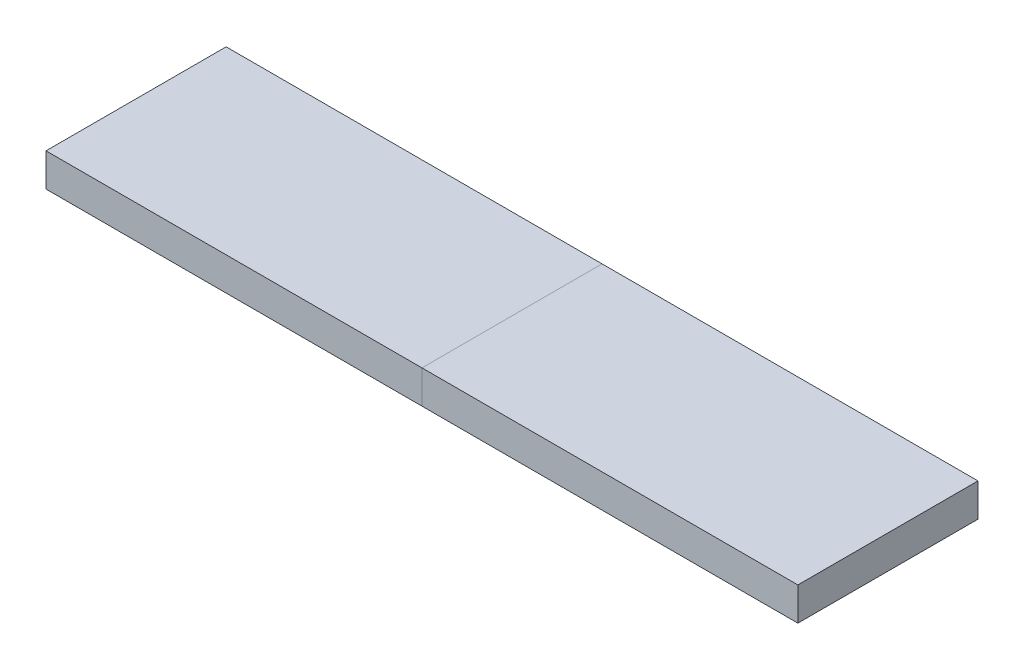
ISO-10303-21;
HEADER;
FILE_DESCRIPTION(('STEP AP214'),'2;1');
FILE_NAME('part.step','',(''),(''),'','','');
FILE_SCHEMA(('AUTOMOTIVE_DESIGN { 1 0 10303 214 1 1 1 1 }'));
ENDSEC;
DATA;
#1=APPLICATION_CONTEXT('core data for automotive mechanical design processes');
#2=APPLICATION_PROTOCOL_DEFINITION('international standard','automotive_design',2000,#1);
#3=PRODUCT_CONTEXT('',#1,'mechanical');
#4=PRODUCT('Part','Part','',(#3));
#5=PRODUCT_RELATED_PRODUCT_CATEGORY('part','',(#4));
#6=PRODUCT_DEFINITION_FORMATION('','',#4);
#7=PRODUCT_DEFINITION_CONTEXT('part definition',#1,'design');
#8=PRODUCT_DEFINITION('design','',#6,#7);
#9=PRODUCT_DEFINITION_SHAPE('','',#8);
#10=(LENGTH_UNIT() NAMED_UNIT(*) SI_UNIT(.MILLI.,.METRE.));
#11=(NAMED_UNIT(*) PLANE_ANGLE_UNIT() SI_UNIT($,.RADIAN.));
#12=(NAMED_UNIT(*) SI_UNIT($,.STERADIAN.) SOLID_ANGLE_UNIT());
#13=UNCERTAINTY_MEASURE_WITH_UNIT(LENGTH_MEASURE(1.E-05),#10,'distance_accuracy_value','');
#14=(GEOMETRIC_REPRESENTATION_CONTEXT(3) GLOBAL_UNCERTAINTY_ASSIGNED_CONTEXT((#13)) GLOBAL_UNIT_ASSIGNED_CONTEXT((#10,
#11,#12)) REPRESENTATION_CONTEXT('',''));
#15=CARTESIAN_POINT('',(0.,0.,0.));
#16=DIRECTION('',(0.,0.,1.));
#17=DIRECTION('',(1.,0.,0.));
#18=AXIS2_PLACEMENT_3D('',#15,#16,#17);
#19=CARTESIAN_POINT('',(0.,-6.36,34.5));
#20=DIRECTION('',(1.,0.,0.));
#21=DIRECTION('',(0.,0.,-1.));
#22=AXIS2_PLACEMENT_3D('',#19,#20,#21);
#23=PLANE('',#22);
#24=DIRECTION('',(0.,-1.,0.));
#25=VECTOR('',#24,1.);
#26=CARTESIAN_POINT('',(0.,6.35,34.5));
#27=LINE('',#26,#25);
#28=CARTESIAN_POINT('',(0.,6.35,34.5));
#29=VERTEX_POINT('',#28);
#30=CARTESIAN_POINT('',(0.,-6.35,34.5));
#31=VERTEX_POINT('',#30);
#32=EDGE_CURVE('E176',#29,#31,#27,.T.);
#33=ORIENTED_EDGE('',*,*,#32,.T.);
#34=DIRECTION('',(0.,0.,-1.));
#35=VECTOR('',#34,1.);
#36=CARTESIAN_POINT('',(0.,-6.35,0.));
#37=LINE('',#36,#35);
#38=CARTESIAN_POINT('',(0.,-6.35,30.95625));
#39=VERTEX_POINT('',#38);
#40=EDGE_CURVE('E179',#31,#39,#37,.T.);
#41=ORIENTED_EDGE('',*,*,#40,.T.);
#42=DIRECTION('',(0.,1.,0.));
#43=VECTOR('',#42,1.);
#44=CARTESIAN_POINT('',(0.,0.,30.95625));
#45=LINE('',#44,#43);
#46=CARTESIAN_POINT('',(0.,0.,30.95625));
#47=VERTEX_POINT('',#46);
#48=EDGE_CURVE('E186',#39,#47,#45,.T.);
#49=ORIENTED_EDGE('',*,*,#48,.T.);
#50=DIRECTION('',(0.,0.,-1.));
#51=VECTOR('',#50,1.);
#52=CARTESIAN_POINT('',(0.,0.,0.));
#53=LINE('',#52,#51);
#54=CARTESIAN_POINT('',(0.,0.,27.5));
#55=VERTEX_POINT('',#54);
#56=EDGE_CURVE('E170',#47,#55,#53,.T.);
#57=ORIENTED_EDGE('',*,*,#56,.T.);
#58=DIRECTION('',(0.,1.,0.));
#59=VECTOR('',#58,1.);
#60=CARTESIAN_POINT('',(0.,4.,27.5));
#61=LINE('',#60,#59);
#62=CARTESIAN_POINT('',(0.,4.,27.5));
#63=VERTEX_POINT('',#62);
#64=EDGE_CURVE('E192',#55,#63,#61,.T.);
#65=ORIENTED_EDGE('',*,*,#64,.T.);
#66=DIRECTION('',(0.,0.,1.));
#67=VECTOR('',#66,1.);
#68=CARTESIAN_POINT('',(0.,4.,0.));
#69=LINE('',#68,#67);
#70=CARTESIAN_POINT('',(0.,4.,-27.5));
#71=VERTEX_POINT('',#70);
#72=EDGE_CURVE('E136',#71,#63,#69,.T.);
#73=ORIENTED_EDGE('',*,*,#72,.F.);
#74=DIRECTION('',(0.,-1.,0.));
#75=VECTOR('',#74,1.);
#76=CARTESIAN_POINT('',(0.,4.,-27.5));
#77=LINE('',#76,#75);
#78=CARTESIAN_POINT('',(0.,0.,-27.5));
#79=VERTEX_POINT('',#78);
#80=EDGE_CURVE('E189',#71,#79,#77,.T.);
#81=ORIENTED_EDGE('',*,*,#80,.T.);
#82=CARTESIAN_POINT('',(0.,0.,-30.95625));
#83=VERTEX_POINT('',#82);
#84=EDGE_CURVE('E171',#79,#83,#53,.T.);
#85=ORIENTED_EDGE('',*,*,#84,.T.);
#86=DIRECTION('',(0.,-1.,0.));
#87=VECTOR('',#86,1.);
#88=CARTESIAN_POINT('',(0.,0.,-30.95625));
#89=LINE('',#88,#87);
#90=CARTESIAN_POINT('',(0.,-6.35,-30.95625));
#91=VERTEX_POINT('',#90);
#92=EDGE_CURVE('E183',#83,#91,#89,.T.);
#93=ORIENTED_EDGE('',*,*,#92,.T.);
#94=CARTESIAN_POINT('',(0.,-6.35,-34.5));
#95=VERTEX_POINT('',#94);
#96=EDGE_CURVE('E180',#91,#95,#37,.T.);
#97=ORIENTED_EDGE('',*,*,#96,.T.);
#98=DIRECTION('',(0.,1.,0.));
#99=VECTOR('',#98,1.);
#100=CARTESIAN_POINT('',(0.,6.35,-34.5));
#101=LINE('',#100,#99);
#102=CARTESIAN_POINT('',(0.,6.35,-34.5));
#103=VERTEX_POINT('',#102);
#104=EDGE_CURVE('E174',#95,#103,#101,.T.);
#105=ORIENTED_EDGE('',*,*,#104,.T.);
#106=DIRECTION('',(0.,0.,-1.));
#107=VECTOR('',#106,1.);
#108=CARTESIAN_POINT('',(0.,6.35,0.));
#109=LINE('',#108,#107);
#110=EDGE_CURVE('E127',#29,#103,#109,.T.);
#111=ORIENTED_EDGE('',*,*,#110,.F.);
#112=EDGE_LOOP('',(#33,#41,#49,#57,#65,#73,#81,#85,#93,#97,#105,#111));
#113=FACE_BOUND('',#112,.T.);
#114=ADVANCED_FACE('F48',(#113),#23,.T.);
#115=CARTESIAN_POINT('',(-144.,6.35,-34.5));
#116=DIRECTION('',(0.,0.,1.));
#117=DIRECTION('',(1.,0.,0.));
#118=AXIS2_PLACEMENT_3D('',#115,#116,#117);
#119=PLANE('',#118);
#120=ORIENTED_EDGE('',*,*,#104,.F.);
#121=DIRECTION('',(-1.,0.,0.));
#122=VECTOR('',#121,1.);
#123=CARTESIAN_POINT('',(-144.,-6.35,-34.5));
#124=LINE('',#123,#122);
#125=CARTESIAN_POINT('',(-144.,-6.35,-34.5));
#126=VERTEX_POINT('',#125);
#127=EDGE_CURVE('E105',#95,#126,#124,.T.);
#128=ORIENTED_EDGE('',*,*,#127,.T.);
#129=DIRECTION('',(0.,-1.,0.));
#130=VECTOR('',#129,1.);
#131=CARTESIAN_POINT('',(-144.,6.35,-34.5));
#132=LINE('',#131,#130);
#133=CARTESIAN_POINT('',(-144.,6.35,-34.5));
#134=VERTEX_POINT('',#133);
#135=EDGE_CURVE('E131',#134,#126,#132,.T.);
#136=ORIENTED_EDGE('',*,*,#135,.F.);
#137=DIRECTION('',(-1.,0.,0.));
#138=VECTOR('',#137,1.);
#139=CARTESIAN_POINT('',(-144.,6.35,-34.5));
#140=LINE('',#139,#138);
#141=EDGE_CURVE('E119',#103,#134,#140,.T.);
#142=ORIENTED_EDGE('',*,*,#141,.F.);
#143=EDGE_LOOP('',(#120,#128,#136,#142));
#144=FACE_BOUND('',#143,.T.);
#145=ADVANCED_FACE('F132',(#144),#119,.F.);
#146=CARTESIAN_POINT('',(-144.,6.35,-34.5));
#147=DIRECTION('',(1.,0.,0.));
#148=DIRECTION('',(0.,0.,-1.));
#149=AXIS2_PLACEMENT_3D('',#146,#147,#148);
#150=PLANE('',#149);
#151=DIRECTION('',(0.,0.,1.));
#152=VECTOR('',#151,1.);
#153=CARTESIAN_POINT('',(-144.,-6.35,-34.5));
#154=LINE('',#153,#152);
#155=CARTESIAN_POINT('',(-144.,-6.35,34.5));
#156=VERTEX_POINT('',#155);
#157=EDGE_CURVE('E146',#126,#156,#154,.T.);
#158=ORIENTED_EDGE('',*,*,#157,.T.);
#159=DIRECTION('',(0.,-1.,0.));
#160=VECTOR('',#159,1.);
#161=CARTESIAN_POINT('',(-144.,6.35,34.5));
#162=LINE('',#161,#160);
#163=CARTESIAN_POINT('',(-144.,6.35,34.5));
#164=VERTEX_POINT('',#163);
#165=EDGE_CURVE('E135',#164,#156,#162,.T.);
#166=ORIENTED_EDGE('',*,*,#165,.F.);
#167=DIRECTION('',(0.,0.,1.));
#168=VECTOR('',#167,1.);
#169=CARTESIAN_POINT('',(-144.,6.35,-34.5));
#170=LINE('',#169,#168);
#171=EDGE_CURVE('E123',#134,#164,#170,.T.);
#172=ORIENTED_EDGE('',*,*,#171,.F.);
#173=ORIENTED_EDGE('',*,*,#135,.T.);
#174=EDGE_LOOP('',(#158,#166,#172,#173));
#175=FACE_BOUND('',#174,.T.);
#176=ADVANCED_FACE('F138',(#175),#150,.F.);
#177=CARTESIAN_POINT('',(-144.,6.35,34.5));
#178=DIRECTION('',(0.,0.,-1.));
#179=DIRECTION('',(-1.,0.,0.));
#180=AXIS2_PLACEMENT_3D('',#177,#178,#179);
#181=PLANE('',#180);
#182=ORIENTED_EDGE('',*,*,#32,.F.);
#183=DIRECTION('',(1.,0.,0.));
#184=VECTOR('',#183,1.);
#185=CARTESIAN_POINT('',(-144.,6.35,34.5));
#186=LINE('',#185,#184);
#187=EDGE_CURVE('E141',#164,#29,#186,.T.);
#188=ORIENTED_EDGE('',*,*,#187,.F.);
#189=ORIENTED_EDGE('',*,*,#165,.T.);
#190=DIRECTION('',(1.,0.,0.));
#191=VECTOR('',#190,1.);
#192=CARTESIAN_POINT('',(-144.,-6.35,34.5));
#193=LINE('',#192,#191);
#194=EDGE_CURVE('E129',#156,#31,#193,.T.);
#195=ORIENTED_EDGE('',*,*,#194,.T.);
#196=EDGE_LOOP('',(#182,#188,#189,#195));
#197=FACE_BOUND('',#196,.T.);
#198=ADVANCED_FACE('F257',(#197),#181,.F.);
#199=CARTESIAN_POINT('',(0.,0.,0.));
#200=DIRECTION('',(0.,1.,0.));
#201=DIRECTION('',(0.,0.,1.));
#202=AXIS2_PLACEMENT_3D('',#199,#200,#201);
#203=PLANE('',#202);
#204=ORIENTED_EDGE('',*,*,#56,.F.);
#205=DIRECTION('',(-1.,0.,0.));
#206=VECTOR('',#205,1.);
#207=CARTESIAN_POINT('',(-140.096875,0.,30.95625));
#208=LINE('',#207,#206);
#209=CARTESIAN_POINT('',(-140.096875,0.,30.95625));
#210=VERTEX_POINT('',#209);
#211=EDGE_CURVE('E157',#47,#210,#208,.T.);
#212=ORIENTED_EDGE('',*,*,#211,.T.);
#213=DIRECTION('',(0.,0.,-1.));
#214=VECTOR('',#213,1.);
#215=CARTESIAN_POINT('',(-140.096875,0.,-30.95625));
#216=LINE('',#215,#214);
#217=CARTESIAN_POINT('',(-140.096875,0.,-30.95625));
#218=VERTEX_POINT('',#217);
#219=EDGE_CURVE('E155',#210,#218,#216,.T.);
#220=ORIENTED_EDGE('',*,*,#219,.T.);
#221=DIRECTION('',(1.,0.,0.));
#222=VECTOR('',#221,1.);
#223=CARTESIAN_POINT('',(-140.096875,0.,-30.95625));
#224=LINE('',#223,#222);
#225=EDGE_CURVE('E150',#218,#83,#224,.T.);
#226=ORIENTED_EDGE('',*,*,#225,.T.);
#227=ORIENTED_EDGE('',*,*,#84,.F.);
#228=DIRECTION('',(1.,0.,0.));
#229=VECTOR('',#228,1.);
#230=CARTESIAN_POINT('',(-135.675,0.,-27.5));
#231=LINE('',#230,#229);
#232=CARTESIAN_POINT('',(-135.675,0.,-27.5));
#233=VERTEX_POINT('',#232);
#234=EDGE_CURVE('E163',#233,#79,#231,.T.);
#235=ORIENTED_EDGE('',*,*,#234,.F.);
#236=DIRECTION('',(0.,0.,-1.));
#237=VECTOR('',#236,1.);
#238=CARTESIAN_POINT('',(-135.675,0.,27.5));
#239=LINE('',#238,#237);
#240=CARTESIAN_POINT('',(-135.675,0.,27.5));
#241=VERTEX_POINT('',#240);
#242=EDGE_CURVE('E57',#241,#233,#239,.T.);
#243=ORIENTED_EDGE('',*,*,#242,.F.);
#244=DIRECTION('',(-1.,0.,0.));
#245=VECTOR('',#244,1.);
#246=CARTESIAN_POINT('',(-135.675,0.,27.5));
#247=LINE('',#246,#245);
#248=EDGE_CURVE('E12',#55,#241,#247,.T.);
#249=ORIENTED_EDGE('',*,*,#248,.F.);
#250=EDGE_LOOP('',(#204,#212,#220,#226,#227,#235,#243,#249));
#251=FACE_BOUND('',#250,.T.);
#252=ADVANCED_FACE('F221',(#251),#203,.F.);
#253=CARTESIAN_POINT('',(-135.675,4.,27.5));
#254=DIRECTION('',(-1.,0.,0.));
#255=DIRECTION('',(0.,0.,1.));
#256=AXIS2_PLACEMENT_3D('',#253,#254,#255);
#257=PLANE('',#256);
#258=ORIENTED_EDGE('',*,*,#242,.T.);
#259=DIRECTION('',(0.,-1.,0.));
#260=VECTOR('',#259,1.);
#261=CARTESIAN_POINT('',(-135.675,4.,-27.5));
#262=LINE('',#261,#260);
#263=CARTESIAN_POINT('',(-135.675,4.,-27.5));
#264=VERTEX_POINT('',#263);
#265=EDGE_CURVE('E75',#264,#233,#262,.T.);
#266=ORIENTED_EDGE('',*,*,#265,.F.);
#267=DIRECTION('',(0.,0.,-1.));
#268=VECTOR('',#267,1.);
#269=CARTESIAN_POINT('',(-135.675,4.,27.5));
#270=LINE('',#269,#268);
#271=CARTESIAN_POINT('',(-135.675,4.,27.5));
#272=VERTEX_POINT('',#271);
#273=EDGE_CURVE('E164',#272,#264,#270,.T.);
#274=ORIENTED_EDGE('',*,*,#273,.F.);
#275=DIRECTION('',(0.,-1.,0.));
#276=VECTOR('',#275,1.);
#277=CARTESIAN_POINT('',(-135.675,4.,27.5));
#278=LINE('',#277,#276);
#279=EDGE_CURVE('E158',#272,#241,#278,.T.);
#280=ORIENTED_EDGE('',*,*,#279,.T.);
#281=EDGE_LOOP('',(#258,#266,#274,#280));
#282=FACE_BOUND('',#281,.T.);
#283=ADVANCED_FACE('F250',(#282),#257,.F.);
#284=CARTESIAN_POINT('',(-135.675,4.,27.5));
#285=DIRECTION('',(0.,0.,1.));
#286=DIRECTION('',(1.,0.,0.));
#287=AXIS2_PLACEMENT_3D('',#284,#285,#286);
#288=PLANE('',#287);
#289=ORIENTED_EDGE('',*,*,#64,.F.);
#290=ORIENTED_EDGE('',*,*,#248,.T.);
#291=ORIENTED_EDGE('',*,*,#279,.F.);
#292=DIRECTION('',(-1.,0.,0.));
#293=VECTOR('',#292,1.);
#294=CARTESIAN_POINT('',(-135.675,4.,27.5));
#295=LINE('',#294,#293);
#296=EDGE_CURVE('E166',#63,#272,#295,.T.);
#297=ORIENTED_EDGE('',*,*,#296,.F.);
#298=EDGE_LOOP('',(#289,#290,#291,#297));
#299=FACE_BOUND('',#298,.T.);
#300=ADVANCED_FACE('F249',(#299),#288,.F.);
#301=CARTESIAN_POINT('',(-135.675,4.,-27.5));
#302=DIRECTION('',(0.,0.,-1.));
#303=DIRECTION('',(-1.,0.,0.));
#304=AXIS2_PLACEMENT_3D('',#301,#302,#303);
#305=PLANE('',#304);
#306=ORIENTED_EDGE('',*,*,#80,.F.);
#307=DIRECTION('',(1.,0.,0.));
#308=VECTOR('',#307,1.);
#309=CARTESIAN_POINT('',(-135.675,4.,-27.5));
#310=LINE('',#309,#308);
#311=EDGE_CURVE('E160',#264,#71,#310,.T.);
#312=ORIENTED_EDGE('',*,*,#311,.F.);
#313=ORIENTED_EDGE('',*,*,#265,.T.);
#314=ORIENTED_EDGE('',*,*,#234,.T.);
#315=EDGE_LOOP('',(#306,#312,#313,#314));
#316=FACE_BOUND('',#315,.T.);
#317=ADVANCED_FACE('F212',(#316),#305,.F.);
#318=CARTESIAN_POINT('',(0.,4.,0.));
#319=DIRECTION('',(0.,-1.,0.));
#320=DIRECTION('',(0.,0.,-1.));
#321=AXIS2_PLACEMENT_3D('',#318,#319,#320);
#322=PLANE('',#321);
#323=ORIENTED_EDGE('',*,*,#311,.T.);
#324=ORIENTED_EDGE('',*,*,#72,.T.);
#325=ORIENTED_EDGE('',*,*,#296,.T.);
#326=ORIENTED_EDGE('',*,*,#273,.T.);
#327=EDGE_LOOP('',(#323,#324,#325,#326));
#328=FACE_BOUND('',#327,.T.);
#329=ADVANCED_FACE('F50',(#328),#322,.T.);
#330=CARTESIAN_POINT('',(-140.096875,0.,-30.95625));
#331=DIRECTION('',(-1.,0.,0.));
#332=DIRECTION('',(0.,0.,1.));
#333=AXIS2_PLACEMENT_3D('',#330,#331,#332);
#334=PLANE('',#333);
#335=DIRECTION('',(0.,0.,-1.));
#336=VECTOR('',#335,1.);
#337=CARTESIAN_POINT('',(-140.096875,-6.35,-30.95625));
#338=LINE('',#337,#336);
#339=CARTESIAN_POINT('',(-140.096875,-6.35,30.95625));
#340=VERTEX_POINT('',#339);
#341=CARTESIAN_POINT('',(-140.096875,-6.35,-30.95625));
#342=VERTEX_POINT('',#341);
#343=EDGE_CURVE('E152',#340,#342,#338,.T.);
#344=ORIENTED_EDGE('',*,*,#343,.T.);
#345=DIRECTION('',(0.,-1.,0.));
#346=VECTOR('',#345,1.);
#347=CARTESIAN_POINT('',(-140.096875,0.,-30.95625));
#348=LINE('',#347,#346);
#349=EDGE_CURVE('E95',#218,#342,#348,.T.);
#350=ORIENTED_EDGE('',*,*,#349,.F.);
#351=ORIENTED_EDGE('',*,*,#219,.F.);
#352=DIRECTION('',(0.,-1.,0.));
#353=VECTOR('',#352,1.);
#354=CARTESIAN_POINT('',(-140.096875,0.,30.95625));
#355=LINE('',#354,#353);
#356=EDGE_CURVE('E148',#210,#340,#355,.T.);
#357=ORIENTED_EDGE('',*,*,#356,.T.);
#358=EDGE_LOOP('',(#344,#350,#351,#357));
#359=FACE_BOUND('',#358,.T.);
#360=ADVANCED_FACE('F279',(#359),#334,.F.);
#361=CARTESIAN_POINT('',(0.,-6.35,0.));
#362=DIRECTION('',(0.,1.,0.));
#363=DIRECTION('',(0.,0.,1.));
#364=AXIS2_PLACEMENT_3D('',#361,#362,#363);
#365=PLANE('',#364);
#366=ORIENTED_EDGE('',*,*,#40,.F.);
#367=ORIENTED_EDGE('',*,*,#194,.F.);
#368=ORIENTED_EDGE('',*,*,#157,.F.);
#369=ORIENTED_EDGE('',*,*,#127,.F.);
#370=ORIENTED_EDGE('',*,*,#96,.F.);
#371=DIRECTION('',(1.,0.,0.));
#372=VECTOR('',#371,1.);
#373=CARTESIAN_POINT('',(-140.096875,-6.35,-30.95625));
#374=LINE('',#373,#372);
#375=EDGE_CURVE('E154',#342,#91,#374,.T.);
#376=ORIENTED_EDGE('',*,*,#375,.F.);
#377=ORIENTED_EDGE('',*,*,#343,.F.);
#378=DIRECTION('',(-1.,0.,0.));
#379=VECTOR('',#378,1.);
#380=CARTESIAN_POINT('',(-140.096875,-6.35,30.95625));
#381=LINE('',#380,#379);
#382=EDGE_CURVE('E84',#39,#340,#381,.T.);
#383=ORIENTED_EDGE('',*,*,#382,.F.);
#384=EDGE_LOOP('',(#366,#367,#368,#369,#370,#376,#377,#383));
#385=FACE_BOUND('',#384,.T.);
#386=ADVANCED_FACE('F275',(#385),#365,.F.);
#387=CARTESIAN_POINT('',(-140.096875,0.,30.95625));
#388=DIRECTION('',(0.,0.,1.));
#389=DIRECTION('',(1.,0.,0.));
#390=AXIS2_PLACEMENT_3D('',#387,#388,#389);
#391=PLANE('',#390);
#392=ORIENTED_EDGE('',*,*,#48,.F.);
#393=ORIENTED_EDGE('',*,*,#382,.T.);
#394=ORIENTED_EDGE('',*,*,#356,.F.);
#395=ORIENTED_EDGE('',*,*,#211,.F.);
#396=EDGE_LOOP('',(#392,#393,#394,#395));
#397=FACE_BOUND('',#396,.T.);
#398=ADVANCED_FACE('F278',(#397),#391,.F.);
#399=CARTESIAN_POINT('',(-140.096875,0.,-30.95625));
#400=DIRECTION('',(0.,0.,-1.));
#401=DIRECTION('',(-1.,0.,0.));
#402=AXIS2_PLACEMENT_3D('',#399,#400,#401);
#403=PLANE('',#402);
#404=ORIENTED_EDGE('',*,*,#92,.F.);
#405=ORIENTED_EDGE('',*,*,#225,.F.);
#406=ORIENTED_EDGE('',*,*,#349,.T.);
#407=ORIENTED_EDGE('',*,*,#375,.T.);
#408=EDGE_LOOP('',(#404,#405,#406,#407));
#409=FACE_BOUND('',#408,.T.);
#410=ADVANCED_FACE('F274',(#409),#403,.F.);
#411=CARTESIAN_POINT('',(0.,6.35,0.));
#412=DIRECTION('',(0.,1.,0.));
#413=DIRECTION('',(0.,0.,1.));
#414=AXIS2_PLACEMENT_3D('',#411,#412,#413);
#415=PLANE('',#414);
#416=ORIENTED_EDGE('',*,*,#187,.T.);
#417=ORIENTED_EDGE('',*,*,#110,.T.);
#418=ORIENTED_EDGE('',*,*,#141,.T.);
#419=ORIENTED_EDGE('',*,*,#171,.T.);
#420=EDGE_LOOP('',(#416,#417,#418,#419));
#421=FACE_BOUND('',#420,.T.);
#422=ADVANCED_FACE('F121',(#421),#415,.T.);
#423=CLOSED_SHELL('',(#114,#145,#176,#198,#252,#283,#300,#317,#329,#360,#386,#398,#410,#422));
#424=MANIFOLD_SOLID_BREP('B2',#423);
#425=CARTESIAN_POINT('',(0.,-6.36,34.5));
#426=DIRECTION('',(1.,0.,0.));
#427=DIRECTION('',(0.,0.,-1.));
#428=AXIS2_PLACEMENT_3D('',#425,#426,#427);
#429=PLANE('',#428);
#430=DIRECTION('',(0.,-1.,0.));
#431=VECTOR('',#430,1.);
#432=CARTESIAN_POINT('',(0.,6.35,34.5));
#433=LINE('',#432,#431);
#434=CARTESIAN_POINT('',(0.,6.35,34.5));
#435=VERTEX_POINT('',#434);
#436=CARTESIAN_POINT('',(0.,-6.35,34.5));
#437=VERTEX_POINT('',#436);
#438=EDGE_CURVE('E565',#435,#437,#433,.T.);
#439=ORIENTED_EDGE('',*,*,#438,.F.);
#440=DIRECTION('',(0.,0.,-1.));
#441=VECTOR('',#440,1.);
#442=CARTESIAN_POINT('',(0.,6.35,0.));
#443=LINE('',#442,#441);
#444=CARTESIAN_POINT('',(0.,6.35,-34.5));
#445=VERTEX_POINT('',#444);
#446=EDGE_CURVE('E386',#435,#445,#443,.T.);
#447=ORIENTED_EDGE('',*,*,#446,.T.);
#448=DIRECTION('',(0.,1.,0.));
#449=VECTOR('',#448,1.);
#450=CARTESIAN_POINT('',(0.,6.35,-34.5));
#451=LINE('',#450,#449);
#452=CARTESIAN_POINT('',(0.,-6.35,-34.5));
#453=VERTEX_POINT('',#452);
#454=EDGE_CURVE('E569',#453,#445,#451,.T.);
#455=ORIENTED_EDGE('',*,*,#454,.F.);
#456=DIRECTION('',(0.,0.,-1.));
#457=VECTOR('',#456,1.);
#458=CARTESIAN_POINT('',(0.,-6.35,0.));
#459=LINE('',#458,#457);
#460=CARTESIAN_POINT('',(0.,-6.35,-30.95625));
#461=VERTEX_POINT('',#460);
#462=EDGE_CURVE('E584',#461,#453,#459,.T.);
#463=ORIENTED_EDGE('',*,*,#462,.F.);
#464=DIRECTION('',(0.,-1.,0.));
#465=VECTOR('',#464,1.);
#466=CARTESIAN_POINT('',(0.,0.,-30.95625));
#467=LINE('',#466,#465);
#468=CARTESIAN_POINT('',(0.,0.,-30.95625));
#469=VERTEX_POINT('',#468);
#470=EDGE_CURVE('E582',#469,#461,#467,.T.);
#471=ORIENTED_EDGE('',*,*,#470,.F.);
#472=DIRECTION('',(0.,0.,-1.));
#473=VECTOR('',#472,1.);
#474=CARTESIAN_POINT('',(0.,0.,0.));
#475=LINE('',#474,#473);
#476=CARTESIAN_POINT('',(0.,0.,-27.5));
#477=VERTEX_POINT('',#476);
#478=EDGE_CURVE('E572',#477,#469,#475,.T.);
#479=ORIENTED_EDGE('',*,*,#478,.F.);
#480=DIRECTION('',(0.,-1.,0.));
#481=VECTOR('',#480,1.);
#482=CARTESIAN_POINT('',(0.,4.,-27.5));
#483=LINE('',#482,#481);
#484=CARTESIAN_POINT('',(0.,4.,-27.5));
#485=VERTEX_POINT('',#484);
#486=EDGE_CURVE('E575',#485,#477,#483,.T.);
#487=ORIENTED_EDGE('',*,*,#486,.F.);
#488=DIRECTION('',(0.,0.,1.));
#489=VECTOR('',#488,1.);
#490=CARTESIAN_POINT('',(0.,4.,0.));
#491=LINE('',#490,#489);
#492=CARTESIAN_POINT('',(0.,4.,27.5));
#493=VERTEX_POINT('',#492);
#494=EDGE_CURVE('E46',#485,#493,#491,.T.);
#495=ORIENTED_EDGE('',*,*,#494,.T.);
#496=DIRECTION('',(0.,1.,0.));
#497=VECTOR('',#496,1.);
#498=CARTESIAN_POINT('',(0.,4.,27.5));
#499=LINE('',#498,#497);
#500=CARTESIAN_POINT('',(0.,0.,27.5));
#501=VERTEX_POINT('',#500);
#502=EDGE_CURVE('E394',#501,#493,#499,.T.);
#503=ORIENTED_EDGE('',*,*,#502,.F.);
#504=CARTESIAN_POINT('',(0.,0.,30.95625));
#505=VERTEX_POINT('',#504);
#506=EDGE_CURVE('E564',#505,#501,#475,.T.);
#507=ORIENTED_EDGE('',*,*,#506,.F.);
#508=DIRECTION('',(0.,1.,0.));
#509=VECTOR('',#508,1.);
#510=CARTESIAN_POINT('',(0.,0.,30.95625));
#511=LINE('',#510,#509);
#512=CARTESIAN_POINT('',(0.,-6.35,30.95625));
#513=VERTEX_POINT('',#512);
#514=EDGE_CURVE('E578',#513,#505,#511,.T.);
#515=ORIENTED_EDGE('',*,*,#514,.F.);
#516=EDGE_CURVE('E380',#437,#513,#459,.T.);
#517=ORIENTED_EDGE('',*,*,#516,.F.);
#518=EDGE_LOOP('',(#439,#447,#455,#463,#471,#479,#487,#495,#503,#507,#515,#517));
#519=FACE_BOUND('',#518,.T.);
#520=ADVANCED_FACE('F377',(#519),#429,.F.);
#521=CARTESIAN_POINT('',(0.,0.,0.));
#522=DIRECTION('',(0.,1.,0.));
#523=DIRECTION('',(0.,0.,1.));
#524=AXIS2_PLACEMENT_3D('',#521,#522,#523);
#525=PLANE('',#524);
#526=DIRECTION('',(-1.,0.,0.));
#527=VECTOR('',#526,1.);
#528=CARTESIAN_POINT('',(-140.096875,0.,30.95625));
#529=LINE('',#528,#527);
#530=CARTESIAN_POINT('',(140.096875,0.,30.95625));
#531=VERTEX_POINT('',#530);
#532=EDGE_CURVE('E507',#531,#505,#529,.T.);
#533=ORIENTED_EDGE('',*,*,#532,.T.);
#534=ORIENTED_EDGE('',*,*,#506,.T.);
#535=DIRECTION('',(-1.,0.,0.));
#536=VECTOR('',#535,1.);
#537=CARTESIAN_POINT('',(-135.675,0.,27.5));
#538=LINE('',#537,#536);
#539=CARTESIAN_POINT('',(135.675,0.,27.5));
#540=VERTEX_POINT('',#539);
#541=EDGE_CURVE('E491',#540,#501,#538,.T.);
#542=ORIENTED_EDGE('',*,*,#541,.F.);
#543=DIRECTION('',(0.,0.,1.));
#544=VECTOR('',#543,1.);
#545=CARTESIAN_POINT('',(135.675,0.,27.5));
#546=LINE('',#545,#544);
#547=CARTESIAN_POINT('',(135.675,0.,-27.5));
#548=VERTEX_POINT('',#547);
#549=EDGE_CURVE('E474',#548,#540,#546,.T.);
#550=ORIENTED_EDGE('',*,*,#549,.F.);
#551=DIRECTION('',(1.,0.,0.));
#552=VECTOR('',#551,1.);
#553=CARTESIAN_POINT('',(-135.675,0.,-27.5));
#554=LINE('',#553,#552);
#555=EDGE_CURVE('E488',#477,#548,#554,.T.);
#556=ORIENTED_EDGE('',*,*,#555,.F.);
#557=ORIENTED_EDGE('',*,*,#478,.T.);
#558=DIRECTION('',(1.,0.,0.));
#559=VECTOR('',#558,1.);
#560=CARTESIAN_POINT('',(-140.096875,0.,-30.95625));
#561=LINE('',#560,#559);
#562=CARTESIAN_POINT('',(140.096875,0.,-30.95625));
#563=VERTEX_POINT('',#562);
#564=EDGE_CURVE('E512',#469,#563,#561,.T.);
#565=ORIENTED_EDGE('',*,*,#564,.T.);
#566=DIRECTION('',(0.,0.,1.));
#567=VECTOR('',#566,1.);
#568=CARTESIAN_POINT('',(140.096875,0.,-30.95625));
#569=LINE('',#568,#567);
#570=EDGE_CURVE('E503',#563,#531,#569,.T.);
#571=ORIENTED_EDGE('',*,*,#570,.T.);
#572=EDGE_LOOP('',(#533,#534,#542,#550,#556,#557,#565,#571));
#573=FACE_BOUND('',#572,.T.);
#574=ADVANCED_FACE('F612',(#573),#525,.F.);
#575=CARTESIAN_POINT('',(144.,6.35,-34.5));
#576=DIRECTION('',(-1.,0.,0.));
#577=DIRECTION('',(0.,0.,1.));
#578=AXIS2_PLACEMENT_3D('',#575,#576,#577);
#579=PLANE('',#578);
#580=DIRECTION('',(0.,0.,-1.));
#581=VECTOR('',#580,1.);
#582=CARTESIAN_POINT('',(144.,-6.35,-34.5));
#583=LINE('',#582,#581);
#584=CARTESIAN_POINT('',(144.,-6.35,34.5));
#585=VERTEX_POINT('',#584);
#586=CARTESIAN_POINT('',(144.,-6.35,-34.5));
#587=VERTEX_POINT('',#586);
#588=EDGE_CURVE('E528',#585,#587,#583,.T.);
#589=ORIENTED_EDGE('',*,*,#588,.T.);
#590=DIRECTION('',(0.,-1.,0.));
#591=VECTOR('',#590,1.);
#592=CARTESIAN_POINT('',(144.,6.35,-34.5));
#593=LINE('',#592,#591);
#594=CARTESIAN_POINT('',(144.,6.35,-34.5));
#595=VERTEX_POINT('',#594);
#596=EDGE_CURVE('E557',#595,#587,#593,.T.);
#597=ORIENTED_EDGE('',*,*,#596,.F.);
#598=DIRECTION('',(0.,0.,-1.));
#599=VECTOR('',#598,1.);
#600=CARTESIAN_POINT('',(144.,6.35,-34.5));
#601=LINE('',#600,#599);
#602=CARTESIAN_POINT('',(144.,6.35,34.5));
#603=VERTEX_POINT('',#602);
#604=EDGE_CURVE('E532',#603,#595,#601,.T.);
#605=ORIENTED_EDGE('',*,*,#604,.F.);
#606=DIRECTION('',(0.,-1.,0.));
#607=VECTOR('',#606,1.);
#608=CARTESIAN_POINT('',(144.,6.35,34.5));
#609=LINE('',#608,#607);
#610=EDGE_CURVE('E544',#603,#585,#609,.T.);
#611=ORIENTED_EDGE('',*,*,#610,.T.);
#612=EDGE_LOOP('',(#589,#597,#605,#611));
#613=FACE_BOUND('',#612,.T.);
#614=ADVANCED_FACE('F620',(#613),#579,.F.);
#615=CARTESIAN_POINT('',(-144.,6.35,-34.5));
#616=DIRECTION('',(0.,0.,1.));
#617=DIRECTION('',(1.,0.,0.));
#618=AXIS2_PLACEMENT_3D('',#615,#616,#617);
#619=PLANE('',#618);
#620=DIRECTION('',(-1.,0.,0.));
#621=VECTOR('',#620,1.);
#622=CARTESIAN_POINT('',(-144.,-6.35,-34.5));
#623=LINE('',#622,#621);
#624=EDGE_CURVE('E548',#587,#453,#623,.T.);
#625=ORIENTED_EDGE('',*,*,#624,.T.);
#626=ORIENTED_EDGE('',*,*,#454,.T.);
#627=DIRECTION('',(-1.,0.,0.));
#628=VECTOR('',#627,1.);
#629=CARTESIAN_POINT('',(-144.,6.35,-34.5));
#630=LINE('',#629,#628);
#631=EDGE_CURVE('E536',#595,#445,#630,.T.);
#632=ORIENTED_EDGE('',*,*,#631,.F.);
#633=ORIENTED_EDGE('',*,*,#596,.T.);
#634=EDGE_LOOP('',(#625,#626,#632,#633));
#635=FACE_BOUND('',#634,.T.);
#636=ADVANCED_FACE('F617',(#635),#619,.F.);
#637=CARTESIAN_POINT('',(-144.,6.35,34.5));
#638=DIRECTION('',(0.,0.,-1.));
#639=DIRECTION('',(-1.,0.,0.));
#640=AXIS2_PLACEMENT_3D('',#637,#638,#639);
#641=PLANE('',#640);
#642=DIRECTION('',(1.,0.,0.));
#643=VECTOR('',#642,1.);
#644=CARTESIAN_POINT('',(-144.,6.35,34.5));
#645=LINE('',#644,#643);
#646=EDGE_CURVE('E541',#435,#603,#645,.T.);
#647=ORIENTED_EDGE('',*,*,#646,.F.);
#648=ORIENTED_EDGE('',*,*,#438,.T.);
#649=DIRECTION('',(1.,0.,0.));
#650=VECTOR('',#649,1.);
#651=CARTESIAN_POINT('',(-144.,-6.35,34.5));
#652=LINE('',#651,#650);
#653=EDGE_CURVE('E537',#437,#585,#652,.T.);
#654=ORIENTED_EDGE('',*,*,#653,.T.);
#655=ORIENTED_EDGE('',*,*,#610,.F.);
#656=EDGE_LOOP('',(#647,#648,#654,#655));
#657=FACE_BOUND('',#656,.T.);
#658=ADVANCED_FACE('F625',(#657),#641,.F.);
#659=CARTESIAN_POINT('',(0.,6.35,0.));
#660=DIRECTION('',(0.,1.,0.));
#661=DIRECTION('',(0.,0.,1.));
#662=AXIS2_PLACEMENT_3D('',#659,#660,#661);
#663=PLANE('',#662);
#664=ORIENTED_EDGE('',*,*,#446,.F.);
#665=ORIENTED_EDGE('',*,*,#646,.T.);
#666=ORIENTED_EDGE('',*,*,#604,.T.);
#667=ORIENTED_EDGE('',*,*,#631,.T.);
#668=EDGE_LOOP('',(#664,#665,#666,#667));
#669=FACE_BOUND('',#668,.T.);
#670=ADVANCED_FACE('F627',(#669),#663,.T.);
#671=CARTESIAN_POINT('',(0.,-6.35,0.));
#672=DIRECTION('',(0.,1.,0.));
#673=DIRECTION('',(0.,0.,1.));
#674=AXIS2_PLACEMENT_3D('',#671,#672,#673);
#675=PLANE('',#674);
#676=ORIENTED_EDGE('',*,*,#653,.F.);
#677=ORIENTED_EDGE('',*,*,#516,.T.);
#678=DIRECTION('',(-1.,0.,0.));
#679=VECTOR('',#678,1.);
#680=CARTESIAN_POINT('',(-140.096875,-6.35,30.95625));
#681=LINE('',#680,#679);
#682=CARTESIAN_POINT('',(140.096875,-6.35,30.95625));
#683=VERTEX_POINT('',#682);
#684=EDGE_CURVE('E518',#683,#513,#681,.T.);
#685=ORIENTED_EDGE('',*,*,#684,.F.);
#686=DIRECTION('',(0.,0.,1.));
#687=VECTOR('',#686,1.);
#688=CARTESIAN_POINT('',(140.096875,-6.35,-30.95625));
#689=LINE('',#688,#687);
#690=CARTESIAN_POINT('',(140.096875,-6.35,-30.95625));
#691=VERTEX_POINT('',#690);
#692=EDGE_CURVE('E501',#691,#683,#689,.T.);
#693=ORIENTED_EDGE('',*,*,#692,.F.);
#694=DIRECTION('',(1.,0.,0.));
#695=VECTOR('',#694,1.);
#696=CARTESIAN_POINT('',(-140.096875,-6.35,-30.95625));
#697=LINE('',#696,#695);
#698=EDGE_CURVE('E508',#461,#691,#697,.T.);
#699=ORIENTED_EDGE('',*,*,#698,.F.);
#700=ORIENTED_EDGE('',*,*,#462,.T.);
#701=ORIENTED_EDGE('',*,*,#624,.F.);
#702=ORIENTED_EDGE('',*,*,#588,.F.);
#703=EDGE_LOOP('',(#676,#677,#685,#693,#699,#700,#701,#702));
#704=FACE_BOUND('',#703,.T.);
#705=ADVANCED_FACE('F597',(#704),#675,.F.);
#706=CARTESIAN_POINT('',(140.096875,0.,-30.95625));
#707=DIRECTION('',(1.,0.,0.));
#708=DIRECTION('',(0.,0.,-1.));
#709=AXIS2_PLACEMENT_3D('',#706,#707,#708);
#710=PLANE('',#709);
#711=ORIENTED_EDGE('',*,*,#692,.T.);
#712=DIRECTION('',(0.,-1.,0.));
#713=VECTOR('',#712,1.);
#714=CARTESIAN_POINT('',(140.096875,0.,30.95625));
#715=LINE('',#714,#713);
#716=EDGE_CURVE('E515',#531,#683,#715,.T.);
#717=ORIENTED_EDGE('',*,*,#716,.F.);
#718=ORIENTED_EDGE('',*,*,#570,.F.);
#719=DIRECTION('',(0.,-1.,0.));
#720=VECTOR('',#719,1.);
#721=CARTESIAN_POINT('',(140.096875,0.,-30.95625));
#722=LINE('',#721,#720);
#723=EDGE_CURVE('E524',#563,#691,#722,.T.);
#724=ORIENTED_EDGE('',*,*,#723,.T.);
#725=EDGE_LOOP('',(#711,#717,#718,#724));
#726=FACE_BOUND('',#725,.T.);
#727=ADVANCED_FACE('F608',(#726),#710,.F.);
#728=CARTESIAN_POINT('',(-140.096875,0.,-30.95625));
#729=DIRECTION('',(0.,0.,-1.));
#730=DIRECTION('',(-1.,0.,0.));
#731=AXIS2_PLACEMENT_3D('',#728,#729,#730);
#732=PLANE('',#731);
#733=ORIENTED_EDGE('',*,*,#564,.F.);
#734=ORIENTED_EDGE('',*,*,#470,.T.);
#735=ORIENTED_EDGE('',*,*,#698,.T.);
#736=ORIENTED_EDGE('',*,*,#723,.F.);
#737=EDGE_LOOP('',(#733,#734,#735,#736));
#738=FACE_BOUND('',#737,.T.);
#739=ADVANCED_FACE('F610',(#738),#732,.F.);
#740=CARTESIAN_POINT('',(-140.096875,0.,30.95625));
#741=DIRECTION('',(0.,0.,1.));
#742=DIRECTION('',(1.,0.,0.));
#743=AXIS2_PLACEMENT_3D('',#740,#741,#742);
#744=PLANE('',#743);
#745=ORIENTED_EDGE('',*,*,#684,.T.);
#746=ORIENTED_EDGE('',*,*,#514,.T.);
#747=ORIENTED_EDGE('',*,*,#532,.F.);
#748=ORIENTED_EDGE('',*,*,#716,.T.);
#749=EDGE_LOOP('',(#745,#746,#747,#748));
#750=FACE_BOUND('',#749,.T.);
#751=ADVANCED_FACE('F605',(#750),#744,.F.);
#752=CARTESIAN_POINT('',(135.675,4.,27.5));
#753=DIRECTION('',(1.,0.,0.));
#754=DIRECTION('',(0.,0.,-1.));
#755=AXIS2_PLACEMENT_3D('',#752,#753,#754);
#756=PLANE('',#755);
#757=ORIENTED_EDGE('',*,*,#549,.T.);
#758=DIRECTION('',(0.,-1.,0.));
#759=VECTOR('',#758,1.);
#760=CARTESIAN_POINT('',(135.675,4.,27.5));
#761=LINE('',#760,#759);
#762=CARTESIAN_POINT('',(135.675,4.,27.5));
#763=VERTEX_POINT('',#762);
#764=EDGE_CURVE('E468',#763,#540,#761,.T.);
#765=ORIENTED_EDGE('',*,*,#764,.F.);
#766=DIRECTION('',(0.,0.,1.));
#767=VECTOR('',#766,1.);
#768=CARTESIAN_POINT('',(135.675,4.,27.5));
#769=LINE('',#768,#767);
#770=CARTESIAN_POINT('',(135.675,4.,-27.5));
#771=VERTEX_POINT('',#770);
#772=EDGE_CURVE('E472',#771,#763,#769,.T.);
#773=ORIENTED_EDGE('',*,*,#772,.F.);
#774=DIRECTION('',(0.,-1.,0.));
#775=VECTOR('',#774,1.);
#776=CARTESIAN_POINT('',(135.675,4.,-27.5));
#777=LINE('',#776,#775);
#778=EDGE_CURVE('E477',#771,#548,#777,.T.);
#779=ORIENTED_EDGE('',*,*,#778,.T.);
#780=EDGE_LOOP('',(#757,#765,#773,#779));
#781=FACE_BOUND('',#780,.T.);
#782=ADVANCED_FACE('F469',(#781),#756,.F.);
#783=CARTESIAN_POINT('',(-135.675,4.,-27.5));
#784=DIRECTION('',(0.,0.,-1.));
#785=DIRECTION('',(-1.,0.,0.));
#786=AXIS2_PLACEMENT_3D('',#783,#784,#785);
#787=PLANE('',#786);
#788=DIRECTION('',(1.,0.,0.));
#789=VECTOR('',#788,1.);
#790=CARTESIAN_POINT('',(-135.675,4.,-27.5));
#791=LINE('',#790,#789);
#792=EDGE_CURVE('E478',#485,#771,#791,.T.);
#793=ORIENTED_EDGE('',*,*,#792,.F.);
#794=ORIENTED_EDGE('',*,*,#486,.T.);
#795=ORIENTED_EDGE('',*,*,#555,.T.);
#796=ORIENTED_EDGE('',*,*,#778,.F.);
#797=EDGE_LOOP('',(#793,#794,#795,#796));
#798=FACE_BOUND('',#797,.T.);
#799=ADVANCED_FACE('F647',(#798),#787,.F.);
#800=CARTESIAN_POINT('',(-135.675,4.,27.5));
#801=DIRECTION('',(0.,0.,1.));
#802=DIRECTION('',(1.,0.,0.));
#803=AXIS2_PLACEMENT_3D('',#800,#801,#802);
#804=PLANE('',#803);
#805=ORIENTED_EDGE('',*,*,#541,.T.);
#806=ORIENTED_EDGE('',*,*,#502,.T.);
#807=DIRECTION('',(-1.,0.,0.));
#808=VECTOR('',#807,1.);
#809=CARTESIAN_POINT('',(-135.675,4.,27.5));
#810=LINE('',#809,#808);
#811=EDGE_CURVE('E480',#763,#493,#810,.T.);
#812=ORIENTED_EDGE('',*,*,#811,.F.);
#813=ORIENTED_EDGE('',*,*,#764,.T.);
#814=EDGE_LOOP('',(#805,#806,#812,#813));
#815=FACE_BOUND('',#814,.T.);
#816=ADVANCED_FACE('F481',(#815),#804,.F.);
#817=CARTESIAN_POINT('',(0.,4.,0.));
#818=DIRECTION('',(0.,-1.,0.));
#819=DIRECTION('',(0.,0.,-1.));
#820=AXIS2_PLACEMENT_3D('',#817,#818,#819);
#821=PLANE('',#820);
#822=ORIENTED_EDGE('',*,*,#494,.F.);
#823=ORIENTED_EDGE('',*,*,#792,.T.);
#824=ORIENTED_EDGE('',*,*,#772,.T.);
#825=ORIENTED_EDGE('',*,*,#811,.T.);
#826=EDGE_LOOP('',(#822,#823,#824,#825));
#827=FACE_BOUND('',#826,.T.);
#828=ADVANCED_FACE('F484',(#827),#821,.T.);
#829=CLOSED_SHELL('',(#520,#574,#614,#636,#658,#670,#705,#727,#739,#751,#782,#799,#816,#828));
#830=MANIFOLD_SOLID_BREP('B6',#829);
#831=ADVANCED_BREP_SHAPE_REPRESENTATION('',(#18,#424,#830),#14);
#832=SHAPE_DEFINITION_REPRESENTATION(#9,#831);
ENDSEC;
END-ISO-10303-21;
